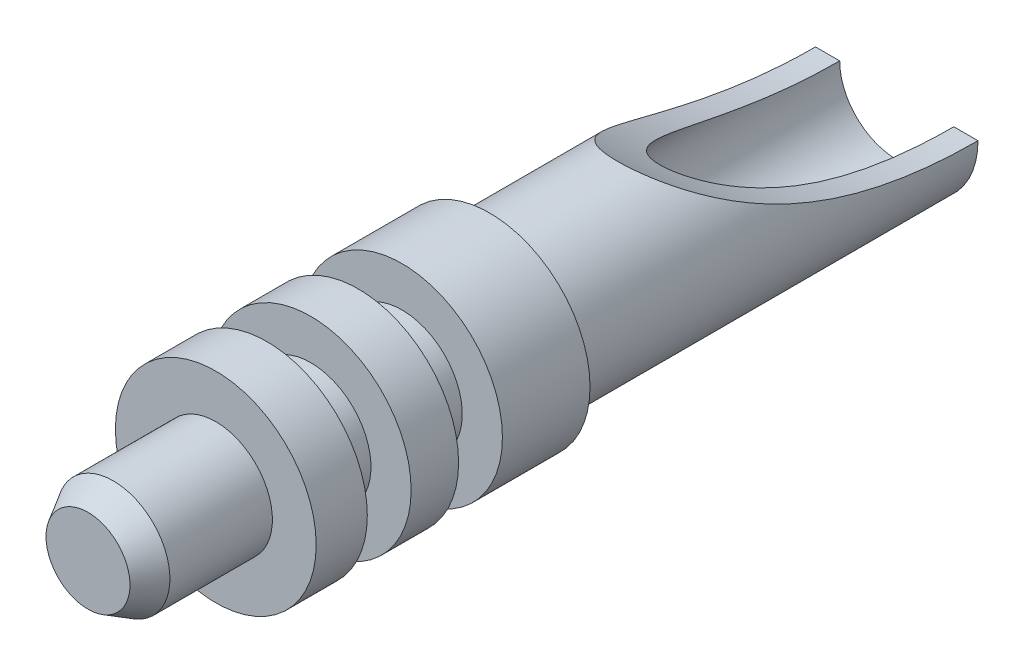
ISO-10303-21;
HEADER;
FILE_DESCRIPTION(('STEP AP214'),'2;1');
FILE_NAME('part.step','',(''),(''),'','','');
FILE_SCHEMA(('AUTOMOTIVE_DESIGN { 1 0 10303 214 1 1 1 1 }'));
ENDSEC;
DATA;
#1=APPLICATION_CONTEXT('core data for automotive mechanical design processes');
#2=APPLICATION_PROTOCOL_DEFINITION('international standard','automotive_design',2000,#1);
#3=PRODUCT_CONTEXT('',#1,'mechanical');
#4=PRODUCT('Part','Part','',(#3));
#5=PRODUCT_RELATED_PRODUCT_CATEGORY('part','',(#4));
#6=PRODUCT_DEFINITION_FORMATION('','',#4);
#7=PRODUCT_DEFINITION_CONTEXT('part definition',#1,'design');
#8=PRODUCT_DEFINITION('design','',#6,#7);
#9=PRODUCT_DEFINITION_SHAPE('','',#8);
#10=(LENGTH_UNIT() NAMED_UNIT(*) SI_UNIT(.MILLI.,.METRE.));
#11=(NAMED_UNIT(*) PLANE_ANGLE_UNIT() SI_UNIT($,.RADIAN.));
#12=(NAMED_UNIT(*) SI_UNIT($,.STERADIAN.) SOLID_ANGLE_UNIT());
#13=UNCERTAINTY_MEASURE_WITH_UNIT(LENGTH_MEASURE(1.E-05),#10,'distance_accuracy_value','');
#14=(GEOMETRIC_REPRESENTATION_CONTEXT(3) GLOBAL_UNCERTAINTY_ASSIGNED_CONTEXT((#13)) GLOBAL_UNIT_ASSIGNED_CONTEXT((#10,
#11,#12)) REPRESENTATION_CONTEXT('',''));
#15=CARTESIAN_POINT('',(0.,0.,0.));
#16=DIRECTION('',(0.,0.,1.));
#17=DIRECTION('',(1.,0.,0.));
#18=AXIS2_PLACEMENT_3D('',#15,#16,#17);
#19=CARTESIAN_POINT('',(0.,0.5842,5.41019971639224));
#20=DIRECTION('',(0.,0.,1.));
#21=DIRECTION('',(1.,0.,0.));
#22=AXIS2_PLACEMENT_3D('',#19,#20,#21);
#23=PLANE('',#22);
#24=CARTESIAN_POINT('',(0.,0.,5.41019971643664));
#25=DIRECTION('',(0.,0.,-1.));
#26=DIRECTION('',(-1.,0.,0.));
#27=AXIS2_PLACEMENT_3D('',#24,#25,#26);
#28=CIRCLE('',#27,0.584199999991597);
#29=CARTESIAN_POINT('',(-0.584199999991597,0.,5.41019971643664));
#30=VERTEX_POINT('',#29);
#31=EDGE_CURVE('E19',#30,#30,#28,.T.);
#32=ORIENTED_EDGE('',*,*,#31,.F.);
#33=EDGE_LOOP('',(#32));
#34=FACE_BOUND('',#33,.T.);
#35=ADVANCED_FACE('F16',(#34),#23,.T.);
#36=CARTESIAN_POINT('',(0.,0.,5.05824699234836));
#37=DIRECTION('',(0.,0.,-1.));
#38=DIRECTION('',(-1.,0.,0.));
#39=AXIS2_PLACEMENT_3D('',#36,#37,#38);
#40=CONICAL_SURFACE('',#39,0.787399999978788,0.52359877558296);
#41=ORIENTED_EDGE('',*,*,#31,.T.);
#42=EDGE_LOOP('',(#41));
#43=FACE_BOUND('',#42,.T.);
#44=CARTESIAN_POINT('',(0.,0.,5.05824699229394));
#45=DIRECTION('',(0.,0.,-1.));
#46=DIRECTION('',(-1.,0.,0.));
#47=AXIS2_PLACEMENT_3D('',#44,#45,#46);
#48=CIRCLE('',#47,0.787400000000188);
#49=CARTESIAN_POINT('',(-0.787400000000188,0.,5.05824699229394));
#50=VERTEX_POINT('',#49);
#51=EDGE_CURVE('E119',#50,#50,#48,.T.);
#52=ORIENTED_EDGE('',*,*,#51,.F.);
#53=EDGE_LOOP('',(#52));
#54=FACE_BOUND('',#53,.T.);
#55=ADVANCED_FACE('F131',(#43,#54),#40,.T.);
#56=CARTESIAN_POINT('',(0.,0.,4.34522335434307));
#57=DIRECTION('',(0.,0.,-1.));
#58=DIRECTION('',(-1.,0.,0.));
#59=AXIS2_PLACEMENT_3D('',#56,#57,#58);
#60=CYLINDRICAL_SURFACE('',#59,0.787400000000188);
#61=ORIENTED_EDGE('',*,*,#51,.T.);
#62=EDGE_LOOP('',(#61));
#63=FACE_BOUND('',#62,.T.);
#64=CARTESIAN_POINT('',(0.,0.,3.63219971639224));
#65=DIRECTION('',(0.,0.,-1.));
#66=DIRECTION('',(-1.,0.,0.));
#67=AXIS2_PLACEMENT_3D('',#64,#65,#66);
#68=CIRCLE('',#67,0.787400000000188);
#69=CARTESIAN_POINT('',(-0.787400000000188,0.,3.63219971639224));
#70=VERTEX_POINT('',#69);
#71=EDGE_CURVE('E122',#70,#70,#68,.T.);
#72=ORIENTED_EDGE('',*,*,#71,.F.);
#73=EDGE_LOOP('',(#72));
#74=FACE_BOUND('',#73,.T.);
#75=ADVANCED_FACE('F138',(#63,#74),#60,.T.);
#76=CARTESIAN_POINT('',(0.,1.39699999999999,3.63219971639224));
#77=DIRECTION('',(0.,0.,1.));
#78=DIRECTION('',(1.,0.,0.));
#79=AXIS2_PLACEMENT_3D('',#76,#77,#78);
#80=PLANE('',#79);
#81=ORIENTED_EDGE('',*,*,#71,.T.);
#82=EDGE_LOOP('',(#81));
#83=FACE_BOUND('',#82,.T.);
#84=CARTESIAN_POINT('',(0.,0.,3.63219971639224));
#85=DIRECTION('',(0.,0.,-1.));
#86=DIRECTION('',(-1.,0.,0.));
#87=AXIS2_PLACEMENT_3D('',#84,#85,#86);
#88=CIRCLE('',#87,1.39699999999999);
#89=CARTESIAN_POINT('',(-1.39699999999999,0.,3.63219971639224));
#90=VERTEX_POINT('',#89);
#91=EDGE_CURVE('E127',#90,#90,#88,.T.);
#92=ORIENTED_EDGE('',*,*,#91,.F.);
#93=EDGE_LOOP('',(#92));
#94=FACE_BOUND('',#93,.T.);
#95=ADVANCED_FACE('F142',(#83,#94),#80,.T.);
#96=CARTESIAN_POINT('',(0.,0.,3.27660004850585));
#97=DIRECTION('',(0.,0.,-1.));
#98=DIRECTION('',(-1.,0.,0.));
#99=AXIS2_PLACEMENT_3D('',#96,#97,#98);
#100=CYLINDRICAL_SURFACE('',#99,1.39699999999999);
#101=ORIENTED_EDGE('',*,*,#91,.T.);
#102=EDGE_LOOP('',(#101));
#103=FACE_BOUND('',#102,.T.);
#104=CARTESIAN_POINT('',(0.,0.,2.92100038061946));
#105=DIRECTION('',(0.,0.,-1.));
#106=DIRECTION('',(-1.,0.,0.));
#107=AXIS2_PLACEMENT_3D('',#104,#105,#106);
#108=CIRCLE('',#107,1.39699999999999);
#109=CARTESIAN_POINT('',(-1.39699999999999,0.,2.92100038061946));
#110=VERTEX_POINT('',#109);
#111=EDGE_CURVE('E200',#110,#110,#108,.T.);
#112=ORIENTED_EDGE('',*,*,#111,.F.);
#113=EDGE_LOOP('',(#112));
#114=FACE_BOUND('',#113,.T.);
#115=ADVANCED_FACE('F147',(#103,#114),#100,.T.);
#116=CARTESIAN_POINT('',(0.,0.838200802978341,2.92100038062489));
#117=DIRECTION('',(0.,0.,-1.));
#118=DIRECTION('',(-1.,0.,0.));
#119=AXIS2_PLACEMENT_3D('',#116,#117,#118);
#120=PLANE('',#119);
#121=CARTESIAN_POINT('',(0.,0.,2.92100038062489));
#122=DIRECTION('',(0.,0.,-1.));
#123=DIRECTION('',(-1.,0.,0.));
#124=AXIS2_PLACEMENT_3D('',#121,#122,#123);
#125=CIRCLE('',#124,0.838200802978341);
#126=CARTESIAN_POINT('',(-0.838200802978341,0.,2.92100038062489));
#127=VERTEX_POINT('',#126);
#128=EDGE_CURVE('E197',#127,#127,#125,.T.);
#129=ORIENTED_EDGE('',*,*,#128,.F.);
#130=EDGE_LOOP('',(#129));
#131=FACE_BOUND('',#130,.T.);
#132=ORIENTED_EDGE('',*,*,#111,.T.);
#133=EDGE_LOOP('',(#132));
#134=FACE_BOUND('',#133,.T.);
#135=ADVANCED_FACE('F151',(#131,#134),#120,.T.);
#136=CARTESIAN_POINT('',(0.,0.,2.61620038062494));
#137=DIRECTION('',(0.,0.,-1.));
#138=DIRECTION('',(-1.,0.,0.));
#139=AXIS2_PLACEMENT_3D('',#136,#137,#138);
#140=CYLINDRICAL_SURFACE('',#139,0.838200802978341);
#141=ORIENTED_EDGE('',*,*,#128,.T.);
#142=EDGE_LOOP('',(#141));
#143=FACE_BOUND('',#142,.T.);
#144=CARTESIAN_POINT('',(0.,0.,2.31140038062501));
#145=DIRECTION('',(0.,0.,-1.));
#146=DIRECTION('',(-1.,0.,0.));
#147=AXIS2_PLACEMENT_3D('',#144,#145,#146);
#148=CIRCLE('',#147,0.838200802978341);
#149=CARTESIAN_POINT('',(-0.838200802978341,0.,2.31140038062501));
#150=VERTEX_POINT('',#149);
#151=EDGE_CURVE('E194',#150,#150,#148,.T.);
#152=ORIENTED_EDGE('',*,*,#151,.F.);
#153=EDGE_LOOP('',(#152));
#154=FACE_BOUND('',#153,.T.);
#155=ADVANCED_FACE('F155',(#143,#154),#140,.T.);
#156=CARTESIAN_POINT('',(0.,1.39700041754873,2.31140038061958));
#157=DIRECTION('',(0.,0.,1.));
#158=DIRECTION('',(1.,0.,0.));
#159=AXIS2_PLACEMENT_3D('',#156,#157,#158);
#160=PLANE('',#159);
#161=ORIENTED_EDGE('',*,*,#151,.T.);
#162=EDGE_LOOP('',(#161));
#163=FACE_BOUND('',#162,.T.);
#164=CARTESIAN_POINT('',(0.,0.,2.31140038061958));
#165=DIRECTION('',(0.,0.,-1.));
#166=DIRECTION('',(-1.,0.,0.));
#167=AXIS2_PLACEMENT_3D('',#164,#165,#166);
#168=CIRCLE('',#167,1.39700020877436);
#169=CARTESIAN_POINT('',(-1.39700020877436,0.,2.31140038061958));
#170=VERTEX_POINT('',#169);
#171=EDGE_CURVE('E191',#170,#170,#168,.T.);
#172=ORIENTED_EDGE('',*,*,#171,.F.);
#173=EDGE_LOOP('',(#172));
#174=FACE_BOUND('',#173,.T.);
#175=ADVANCED_FACE('F159',(#163,#174),#160,.T.);
#176=CARTESIAN_POINT('',(0.,0.,1.98120038061958));
#177=DIRECTION('',(0.,0.,-1.));
#178=DIRECTION('',(-1.,0.,0.));
#179=AXIS2_PLACEMENT_3D('',#176,#177,#178);
#180=CYLINDRICAL_SURFACE('',#179,1.39700020877436);
#181=ORIENTED_EDGE('',*,*,#171,.T.);
#182=EDGE_LOOP('',(#181));
#183=FACE_BOUND('',#182,.T.);
#184=CARTESIAN_POINT('',(0.,0.,1.65100038061958));
#185=DIRECTION('',(0.,0.,-1.));
#186=DIRECTION('',(-1.,0.,0.));
#187=AXIS2_PLACEMENT_3D('',#184,#185,#186);
#188=CIRCLE('',#187,1.39700020877436);
#189=CARTESIAN_POINT('',(-1.39700020877436,0.,1.65100038061958));
#190=VERTEX_POINT('',#189);
#191=EDGE_CURVE('E186',#190,#190,#188,.T.);
#192=ORIENTED_EDGE('',*,*,#191,.F.);
#193=EDGE_LOOP('',(#192));
#194=FACE_BOUND('',#193,.T.);
#195=ADVANCED_FACE('F163',(#183,#194),#180,.T.);
#196=CARTESIAN_POINT('',(0.,0.8382003854296,1.65100038062498));
#197=DIRECTION('',(0.,0.,-1.));
#198=DIRECTION('',(-1.,0.,0.));
#199=AXIS2_PLACEMENT_3D('',#196,#197,#198);
#200=PLANE('',#199);
#201=CARTESIAN_POINT('',(0.,0.,1.65100038062498));
#202=DIRECTION('',(0.,0.,-1.));
#203=DIRECTION('',(-1.,0.,0.));
#204=AXIS2_PLACEMENT_3D('',#201,#202,#203);
#205=CIRCLE('',#204,0.838200192714796);
#206=CARTESIAN_POINT('',(-0.838200192714796,0.,1.65100038062498));
#207=VERTEX_POINT('',#206);
#208=EDGE_CURVE('E179',#207,#207,#205,.T.);
#209=ORIENTED_EDGE('',*,*,#208,.F.);
#210=EDGE_LOOP('',(#209));
#211=FACE_BOUND('',#210,.T.);
#212=ORIENTED_EDGE('',*,*,#191,.T.);
#213=EDGE_LOOP('',(#212));
#214=FACE_BOUND('',#213,.T.);
#215=ADVANCED_FACE('F167',(#211,#214),#200,.T.);
#216=CARTESIAN_POINT('',(0.,0.,1.34620038062512));
#217=DIRECTION('',(0.,0.,-1.));
#218=DIRECTION('',(-1.,0.,0.));
#219=AXIS2_PLACEMENT_3D('',#216,#217,#218);
#220=CYLINDRICAL_SURFACE('',#219,0.838200192714796);
#221=ORIENTED_EDGE('',*,*,#208,.T.);
#222=EDGE_LOOP('',(#221));
#223=FACE_BOUND('',#222,.T.);
#224=CARTESIAN_POINT('',(0.,0.,1.04140038062526));
#225=DIRECTION('',(0.,0.,-1.));
#226=DIRECTION('',(-1.,0.,0.));
#227=AXIS2_PLACEMENT_3D('',#224,#225,#226);
#228=CIRCLE('',#227,0.838200192714796);
#229=CARTESIAN_POINT('',(-0.838200192714796,0.,1.04140038062526));
#230=VERTEX_POINT('',#229);
#231=EDGE_CURVE('E182',#230,#230,#228,.T.);
#232=ORIENTED_EDGE('',*,*,#231,.F.);
#233=EDGE_LOOP('',(#232));
#234=FACE_BOUND('',#233,.T.);
#235=ADVANCED_FACE('F63',(#223,#234),#220,.T.);
#236=CARTESIAN_POINT('',(0.,1.39699999999999,1.04140082350681));
#237=DIRECTION('',(0.,0.,1.));
#238=DIRECTION('',(1.,0.,0.));
#239=AXIS2_PLACEMENT_3D('',#236,#237,#238);
#240=PLANE('',#239);
#241=ORIENTED_EDGE('',*,*,#231,.T.);
#242=EDGE_LOOP('',(#241));
#243=FACE_BOUND('',#242,.T.);
#244=CARTESIAN_POINT('',(0.,0.,1.04140082350681));
#245=DIRECTION('',(0.,0.,-1.));
#246=DIRECTION('',(-1.,0.,0.));
#247=AXIS2_PLACEMENT_3D('',#244,#245,#246);
#248=CIRCLE('',#247,1.39699999999999);
#249=CARTESIAN_POINT('',(-1.39699999999999,0.,1.04140082350681));
#250=VERTEX_POINT('',#249);
#251=EDGE_CURVE('E116',#250,#250,#248,.T.);
#252=ORIENTED_EDGE('',*,*,#251,.F.);
#253=EDGE_LOOP('',(#252));
#254=FACE_BOUND('',#253,.T.);
#255=ADVANCED_FACE('F52',(#243,#254),#240,.T.);
#256=CARTESIAN_POINT('',(0.,0.,-0.177800283609031));
#257=DIRECTION('',(0.,0.,-1.));
#258=DIRECTION('',(-1.,0.,0.));
#259=AXIS2_PLACEMENT_3D('',#256,#257,#258);
#260=CONICAL_SURFACE('',#259,0.793749999900228,0.785398163182607);
#261=CARTESIAN_POINT('',(0.,0.,-0.177800283697822));
#262=DIRECTION('',(0.,0.,-1.));
#263=DIRECTION('',(-1.,0.,0.));
#264=AXIS2_PLACEMENT_3D('',#261,#262,#263);
#265=CIRCLE('',#264,0.793750000006584);
#266=CARTESIAN_POINT('',(-0.793750000006584,0.,-0.177800283697822));
#267=VERTEX_POINT('',#266);
#268=EDGE_CURVE('E114',#267,#267,#265,.T.);
#269=ORIENTED_EDGE('',*,*,#268,.T.);
#270=EDGE_LOOP('',(#269));
#271=FACE_BOUND('',#270,.T.);
#272=CARTESIAN_POINT('',(0.,1.70530256582424E-10,0.615949716461728));
#273=VERTEX_POINT('',#272);
#274=VERTEX_LOOP('',#273);
#275=FACE_BOUND('',#274,.T.);
#276=ADVANCED_FACE('F49',(#271,#275),#260,.F.);
#277=CARTESIAN_POINT('',(0.,0.,0.431800269904497));
#278=DIRECTION('',(0.,0.,-1.));
#279=DIRECTION('',(-1.,0.,0.));
#280=AXIS2_PLACEMENT_3D('',#277,#278,#279);
#281=CYLINDRICAL_SURFACE('',#280,1.39699999999999);
#282=ORIENTED_EDGE('',*,*,#251,.T.);
#283=EDGE_LOOP('',(#282));
#284=FACE_BOUND('',#283,.T.);
#285=CARTESIAN_POINT('',(0.,0.,-0.177800283697821));
#286=DIRECTION('',(0.,0.,-1.));
#287=DIRECTION('',(-1.,0.,0.));
#288=AXIS2_PLACEMENT_3D('',#285,#286,#287);
#289=CIRCLE('',#288,1.39699999999999);
#290=CARTESIAN_POINT('',(-1.39699999999999,0.,-0.177800283697821));
#291=VERTEX_POINT('',#290);
#292=EDGE_CURVE('E112',#291,#291,#289,.T.);
#293=ORIENTED_EDGE('',*,*,#292,.F.);
#294=EDGE_LOOP('',(#293));
#295=FACE_BOUND('',#294,.T.);
#296=ADVANCED_FACE('F51',(#284,#295),#281,.T.);
#297=CARTESIAN_POINT('',(0.,0.,-3.00990014184892));
#298=DIRECTION('',(0.,0.,-1.));
#299=DIRECTION('',(-1.,0.,0.));
#300=AXIS2_PLACEMENT_3D('',#297,#298,#299);
#301=CYLINDRICAL_SURFACE('',#300,0.793750000006584);
#302=ORIENTED_EDGE('',*,*,#268,.F.);
#303=EDGE_LOOP('',(#302));
#304=FACE_BOUND('',#303,.T.);
#305=CARTESIAN_POINT('',(0.,0.,-5.84200000000003));
#306=DIRECTION('',(0.,0.,-1.));
#307=DIRECTION('',(-1.,0.,0.));
#308=AXIS2_PLACEMENT_3D('',#305,#306,#307);
#309=CIRCLE('',#308,0.793750000006584);
#310=CARTESIAN_POINT('',(-0.793750000006584,0.,-5.84200000000001));
#311=VERTEX_POINT('',#310);
#312=CARTESIAN_POINT('',(0.793750000006583,-1.07642140360867E-13,-5.842));
#313=VERTEX_POINT('',#312);
#314=EDGE_CURVE('E45',#311,#313,#309,.F.);
#315=ORIENTED_EDGE('',*,*,#314,.F.);
#316=CARTESIAN_POINT('',(-0.793750000006584,0.,-5.842));
#317=CARTESIAN_POINT('',(-0.793745072714793,4.47134431419849E-08,-5.77563910056315));
#318=CARTESIAN_POINT('',(-0.793750674467001,0.000911709170151779,-5.70928178208783));
#319=CARTESIAN_POINT('',(-0.793739904721889,0.00455739106543424,-5.57661680377649));
#320=CARTESIAN_POINT('',(-0.79372353308365,0.00729142019101399,-5.51030914426166));
#321=CARTESIAN_POINT('',(-0.793576865813522,0.0182289820760601,-5.31146614134481));
#322=CARTESIAN_POINT('',(-0.793348944898373,0.0291679884353135,-5.17907047654982));
#323=CARTESIAN_POINT('',(-0.791731736571994,0.0584418052007496,-4.91383544317004));
#324=CARTESIAN_POINT('',(-0.79033139415905,0.0768461530721461,-4.78100388455027));
#325=CARTESIAN_POINT('',(-0.784793757532293,0.120984599252998,-4.51663359655988));
#326=CARTESIAN_POINT('',(-0.780657270887894,0.146716533559041,-4.38509449734355));
#327=CARTESIAN_POINT('',(-0.770244763805324,0.192460858753782,-4.18136975671162));
#328=CARTESIAN_POINT('',(-0.765711080449191,0.21000779955197,-4.10853571890765));
#329=CARTESIAN_POINT('',(-0.754493369796887,0.247304652771115,-3.96361395815997));
#330=CARTESIAN_POINT('',(-0.747809935979546,0.267053956206744,-3.89152603490013));
#331=CARTESIAN_POINT('',(-0.731632473307787,0.308625129114248,-3.74847945569802));
#332=CARTESIAN_POINT('',(-0.72214629365652,0.330441096409037,-3.6775182215873));
#333=CARTESIAN_POINT('',(-0.699479459381219,0.376054812045032,-3.53683813125736));
#334=CARTESIAN_POINT('',(-0.68629994572098,0.399851946760421,-3.46711889841592));
#335=CARTESIAN_POINT('',(-0.654471742726663,0.450141562589354,-3.32674223509212));
#336=CARTESIAN_POINT('',(-0.63563265181978,0.476702419469,-3.25615140401202));
#337=CARTESIAN_POINT('',(-0.590882851879046,0.531174523504976,-3.11784235861526));
#338=CARTESIAN_POINT('',(-0.564987194272188,0.559082793587976,-3.05011838063773));
#339=CARTESIAN_POINT('',(-0.512494274570774,0.606828171858658,-2.93884195298036));
#340=CARTESIAN_POINT('',(-0.488398997710889,0.626595689509811,-2.89409380081179));
#341=CARTESIAN_POINT('',(-0.433915354885701,0.665492720444561,-2.80826898988383));
#342=CARTESIAN_POINT('',(-0.403543099609246,0.684623724278987,-2.76718330991133));
#343=CARTESIAN_POINT('',(-0.349640571394023,0.712931490359794,-2.70767446967969));
#344=CARTESIAN_POINT('',(-0.328839578711178,0.72283247158768,-2.68713982252322));
#345=CARTESIAN_POINT('',(-0.284307323811903,0.741478672484714,-2.64887487533219));
#346=CARTESIAN_POINT('',(-0.26057920244541,0.750225110482441,-2.6311416151887));
#347=CARTESIAN_POINT('',(-0.215277412068541,0.764286971037071,-2.60286632005315));
#348=CARTESIAN_POINT('',(-0.194268774165629,0.769937974911433,-2.59159545137628));
#349=CARTESIAN_POINT('',(-0.150478304835319,0.779676721874569,-2.57226424226923));
#350=CARTESIAN_POINT('',(-0.127699124724625,0.783766750176207,-2.56419920788718));
#351=CARTESIAN_POINT('',(-0.0843487326262779,0.789511485008108,-2.55289983428004));
#352=CARTESIAN_POINT('',(-0.06395634294216,0.791438804489411,-2.54912367041116));
#353=CARTESIAN_POINT('',(-0.0227473002939425,0.793691704090161,-2.54471127064433));
#354=CARTESIAN_POINT('',(-0.00193086957465204,0.794018102631453,-2.54407343037393));
#355=CARTESIAN_POINT('',(0.039506732925389,0.793037127809266,-2.54599333993579));
#356=CARTESIAN_POINT('',(0.0601279480419586,0.79173012603982,-2.5485503629455));
#357=CARTESIAN_POINT('',(0.100620251475667,0.787610327473623,-2.55663660894271));
#358=CARTESIAN_POINT('',(0.120490806154396,0.784796480262608,-2.56216790529207));
#359=CARTESIAN_POINT('',(0.1648719462376,0.776856104875197,-2.57785138605341));
#360=CARTESIAN_POINT('',(0.188987800635821,0.771289156891959,-2.58889173194683));
#361=CARTESIAN_POINT('',(0.234911624847708,0.758568855847461,-2.61433297532679));
#362=CARTESIAN_POINT('',(0.256714740646138,0.751412260081629,-2.62874074516636));
#363=CARTESIAN_POINT('',(0.309259776611348,0.731819089374931,-2.66858474436038));
#364=CARTESIAN_POINT('',(0.338395314606695,0.718630946940319,-2.69575139801168));
#365=CARTESIAN_POINT('',(0.391846727747439,0.690944456945323,-2.75384577622739));
#366=CARTESIAN_POINT('',(0.416151393600319,0.676443173261403,-2.78478198547757));
#367=CARTESIAN_POINT('',(0.459511078337832,0.647707115429486,-2.84732765458962));
#368=CARTESIAN_POINT('',(0.478783425428324,0.633502661215112,-2.87880310264737));
#369=CARTESIAN_POINT('',(0.514378537111737,0.604958306501471,-2.94333969322483));
#370=CARTESIAN_POINT('',(0.530698561867391,0.590618293051567,-2.97640227301385));
#371=CARTESIAN_POINT('',(0.560894456647505,0.562022558686372,-3.04374816949809));
#372=CARTESIAN_POINT('',(0.574764841621003,0.54776709431636,-3.07803402414673));
#373=CARTESIAN_POINT('',(0.600404783274252,0.519534458058143,-3.14746863255609));
#374=CARTESIAN_POINT('',(0.612175091269772,0.505557188240448,-3.18261707258158));
#375=CARTESIAN_POINT('',(0.638408688896,0.472322874976223,-3.26816641354489));
#376=CARTESIAN_POINT('',(0.651995307197426,0.45325266253917,-3.31890806971213));
#377=CARTESIAN_POINT('',(0.676336508990074,0.416052136808957,-3.42141307327005));
#378=CARTESIAN_POINT('',(0.687089828390324,0.397922245932515,-3.47317686565835));
#379=CARTESIAN_POINT('',(0.715950737778844,0.34507906167727,-3.62978750308774));
#380=CARTESIAN_POINT('',(0.730619389353738,0.31196774129816,-3.73581132009913));
#381=CARTESIAN_POINT('',(0.753952739367213,0.250350456127041,-3.95045816664053));
#382=CARTESIAN_POINT('',(0.762580900618215,0.221873303655325,-4.05909297145223));
#383=CARTESIAN_POINT('',(0.775797409755612,0.169979254672727,-4.27770215798248));
#384=CARTESIAN_POINT('',(0.780388977239767,0.146558336566351,-4.38767540104308));
#385=CARTESIAN_POINT('',(0.787106871049683,0.104664731840435,-4.60964321194316));
#386=CARTESIAN_POINT('',(0.789210788722427,0.0862381593983793,-4.72164706102088));
#387=CARTESIAN_POINT('',(0.792024078559455,0.0546608981445967,-4.9464361385479));
#388=CARTESIAN_POINT('',(0.792733118644014,0.0415114662592921,-5.05922154665178));
#389=CARTESIAN_POINT('',(0.793548030166539,0.0206848541948833,-5.28358018396129));
#390=CARTESIAN_POINT('',(0.793662865992193,0.0129278823684445,-5.3951459320824));
#391=CARTESIAN_POINT('',(0.793736715299938,0.00517123240290424,-5.56264753256495));
#392=CARTESIAN_POINT('',(0.793744936281703,0.00323215046426472,-5.61849967962116));
#393=CARTESIAN_POINT('',(0.793750325389373,0.000646537018439649,-5.73023387458225));
#394=CARTESIAN_POINT('',(0.793747493517524,5.24863010660097E-09,-5.78611592248105));
#395=CARTESIAN_POINT('',(0.793750000006583,-1.07402628612572E-13,-5.842));
#396=B_SPLINE_CURVE_WITH_KNOTS('',3,(#316,#317,#318,#319,#320,#321,#322,#323,#324,#325,#326,
#327,#328,#329,#330,#331,#332,#333,#334,#335,#336,#337,#338,#339,#340,#341,#342,#343,#344,#345,
#346,#347,#348,#349,#350,#351,#352,#353,#354,#355,#356,#357,#358,#359,#360,#361,#362,#363,#364,
#365,#366,#367,#368,#369,#370,#371,#372,#373,#374,#375,#376,#377,#378,#379,#380,#381,#382,#383,
#384,#385,#386,#387,#388,#389,#390,#391,#392,#393,#394,#395),.UNSPECIFIED.,.F.,.F.,(4,2,2,2,2,2,
2,2,2,2,2,2,2,2,2,2,2,2,2,2,2,2,2,2,2,2,2,2,2,2,2,2,2,2,2,2,2,2,2,4),(0.,0.199069277043777,
0.398139830750915,0.796459803533338,1.19857847810447,1.60057852079743,1.82569030968455,
2.05074000551331,2.2751653199953,2.49952138013613,2.73248361349462,2.96495278371441,
3.12824318061488,3.29111956340222,3.38349228125217,3.47576673023047,3.54900939437878,
3.62214441876734,3.68434904400335,3.74652186571123,3.80868054584931,3.87088261299867,
3.9517315426995,4.03274693504561,4.15792642441056,4.28339306698314,4.40185501628169,
4.52042634381554,4.63925989117591,4.75805083946715,4.92558369823146,5.0931911765633,
5.42887754111278,5.76657723065022,6.10400732501941,6.44445436531979,6.78498244634083,
7.12035789416721,7.2880023631975,7.45564679816532),.UNSPECIFIED.);
#397=EDGE_CURVE('E88',#311,#313,#396,.T.);
#398=ORIENTED_EDGE('',*,*,#397,.T.);
#399=EDGE_LOOP('',(#315,#398));
#400=FACE_BOUND('',#399,.T.);
#401=ADVANCED_FACE('F60',(#304,#400),#301,.F.);
#402=CARTESIAN_POINT('',(0.,1.13030000001319,-0.177800283697821));
#403=DIRECTION('',(0.,0.,-1.));
#404=DIRECTION('',(-1.,0.,0.));
#405=AXIS2_PLACEMENT_3D('',#402,#403,#404);
#406=PLANE('',#405);
#407=CARTESIAN_POINT('',(0.,0.,-0.177800283697822));
#408=DIRECTION('',(0.,0.,-1.));
#409=DIRECTION('',(-1.,0.,0.));
#410=AXIS2_PLACEMENT_3D('',#407,#408,#409);
#411=CIRCLE('',#410,1.1303000000066);
#412=CARTESIAN_POINT('',(-1.1303000000066,0.,-0.177800283697822));
#413=VERTEX_POINT('',#412);
#414=EDGE_CURVE('E11',#413,#413,#411,.T.);
#415=ORIENTED_EDGE('',*,*,#414,.F.);
#416=EDGE_LOOP('',(#415));
#417=FACE_BOUND('',#416,.T.);
#418=ORIENTED_EDGE('',*,*,#292,.T.);
#419=EDGE_LOOP('',(#418));
#420=FACE_BOUND('',#419,.T.);
#421=ADVANCED_FACE('F100',(#417,#420),#406,.T.);
#422=CARTESIAN_POINT('',(0.,0.79375,-5.842));
#423=DIRECTION('',(0.,0.,-1.));
#424=DIRECTION('',(-1.,0.,0.));
#425=AXIS2_PLACEMENT_3D('',#422,#423,#424);
#426=PLANE('',#425);
#427=DIRECTION('',(1.,0.,0.));
#428=VECTOR('',#427,1.);
#429=CARTESIAN_POINT('',(1.30985766934386E-13,0.,-5.84200000000002));
#430=LINE('',#429,#428);
#431=CARTESIAN_POINT('',(1.1303000000066,-1.21338772118349E-13,-5.842));
#432=VERTEX_POINT('',#431);
#433=EDGE_CURVE('E108',#313,#432,#430,.T.);
#434=ORIENTED_EDGE('',*,*,#433,.T.);
#435=CARTESIAN_POINT('',(0.,0.,-5.842));
#436=DIRECTION('',(0.,0.,-1.));
#437=DIRECTION('',(-1.,0.,0.));
#438=AXIS2_PLACEMENT_3D('',#435,#436,#437);
#439=CIRCLE('',#438,1.1303000000066);
#440=CARTESIAN_POINT('',(-1.1303000000066,0.,-5.84200000000002));
#441=VERTEX_POINT('',#440);
#442=EDGE_CURVE('E25',#441,#432,#439,.F.);
#443=ORIENTED_EDGE('',*,*,#442,.F.);
#444=DIRECTION('',(1.,0.,0.));
#445=VECTOR('',#444,1.);
#446=CARTESIAN_POINT('',(1.30985766934384E-13,0.,-5.84199999999997));
#447=LINE('',#446,#445);
#448=EDGE_CURVE('E95',#441,#311,#447,.T.);
#449=ORIENTED_EDGE('',*,*,#448,.T.);
#450=ORIENTED_EDGE('',*,*,#314,.T.);
#451=EDGE_LOOP('',(#434,#443,#449,#450));
#452=FACE_BOUND('',#451,.T.);
#453=ADVANCED_FACE('F75',(#452),#426,.T.);
#454=CARTESIAN_POINT('',(4.19031679890433E-13,7.24591981105692,-5.842));
#455=DIRECTION('',(1.,0.,0.));
#456=DIRECTION('',(0.,1.,0.));
#457=AXIS2_PLACEMENT_3D('',#454,#455,#456);
#458=CYLINDRICAL_SURFACE('',#457,7.245919811057);
#459=ORIENTED_EDGE('',*,*,#448,.F.);
#460=CARTESIAN_POINT('',(1.1303000000066,-1.21417072801188E-13,-5.842));
#461=CARTESIAN_POINT('',(1.13027922073295,-1.0856042204325E-06,-5.74595397538415));
#462=CARTESIAN_POINT('',(1.13029927365783,0.00190962221959341,-5.64990798210759));
#463=CARTESIAN_POINT('',(1.13027169562796,0.00954700347392156,-5.45796363835748));
#464=CARTESIAN_POINT('',(1.13022406171017,0.0152738439522964,-5.36206529453136));
#465=CARTESIAN_POINT('',(1.12991130641871,0.0305569275643506,-5.17030803073961));
#466=CARTESIAN_POINT('',(1.12964558520041,0.0401236952123167,-5.07444994994745));
#467=CARTESIAN_POINT('',(1.12859783048165,0.0630704690742066,-4.88319622709102));
#468=CARTESIAN_POINT('',(1.12781581171734,0.0764503664477951,-4.7878005719065));
#469=CARTESIAN_POINT('',(1.12533710580411,0.106891677502504,-4.59830622792761));
#470=CARTESIAN_POINT('',(1.12364697251541,0.12392619306812,-4.5042031408764));
#471=CARTESIAN_POINT('',(1.1188362768455,0.161698099260662,-4.3167806808706));
#472=CARTESIAN_POINT('',(1.11571577481791,0.182435333630873,-4.22346127501818));
#473=CARTESIAN_POINT('',(1.10739957808593,0.227528675021003,-4.03793812597343));
#474=CARTESIAN_POINT('',(1.1022069817626,0.25187934491288,-3.94573292785677));
#475=CARTESIAN_POINT('',(1.08894746464063,0.30413733761125,-3.76255900536585));
#476=CARTESIAN_POINT('',(1.08088137214526,0.332043633998655,-3.67158993250741));
#477=CARTESIAN_POINT('',(1.06539748077918,0.377886783659841,-3.531982130244));
#478=CARTESIAN_POINT('',(1.05933504586406,0.394627405982293,-3.48279818063623));
#479=CARTESIAN_POINT('',(1.04584632718759,0.429098122982193,-3.38497167850433));
#480=CARTESIAN_POINT('',(1.03842008077581,0.446828190553291,-3.3363291111925));
#481=CARTESIAN_POINT('',(1.01369207095322,0.501626214262065,-3.19084732730463));
#482=CARTESIAN_POINT('',(0.993988856967758,0.540147652731032,-3.0949234746035));
#483=CARTESIAN_POINT('',(0.953980275244724,0.60701309725412,-2.93804867213609));
#484=CARTESIAN_POINT('',(0.936068509192591,0.634465314423898,-2.87610597075144));
#485=CARTESIAN_POINT('',(0.8955316479135,0.690507602603299,-2.75421442137698));
#486=CARTESIAN_POINT('',(0.87290300402502,0.719098517116214,-2.69426711419263));
#487=CARTESIAN_POINT('',(0.822073103822238,0.776685026972787,-2.57756146974296));
#488=CARTESIAN_POINT('',(0.793912876903528,0.805676263292606,-2.52078338477578));
#489=CARTESIAN_POINT('',(0.7306988754887,0.863416713015041,-2.41113662606744));
#490=CARTESIAN_POINT('',(0.695659903397217,0.892166310250554,-2.35825988738032));
#491=CARTESIAN_POINT('',(0.629487023930969,0.939370687970391,-2.27375706713438));
#492=CARTESIAN_POINT('',(0.60055003235294,0.958236950118211,-2.24065093375772));
#493=CARTESIAN_POINT('',(0.538222802227507,0.994583777038289,-2.17792266577088));
#494=CARTESIAN_POINT('',(0.504828852450851,1.01206316743459,-2.14830347378258));
#495=CARTESIAN_POINT('',(0.432903311097379,1.04486923869048,-2.09348594779525));
#496=CARTESIAN_POINT('',(0.394319559130946,1.06017030492407,-2.06833946690346));
#497=CARTESIAN_POINT('',(0.312450864544377,1.0871042417902,-2.02453882989633));
#498=CARTESIAN_POINT('',(0.26917596913673,1.09874475153331,-2.00587114480945));
#499=CARTESIAN_POINT('',(0.1883308360043,1.11509606306809,-1.9798061513293));
#500=CARTESIAN_POINT('',(0.151450305352209,1.12074531120149,-1.97087109793088));
#501=CARTESIAN_POINT('',(0.0763768168082536,1.12834498778049,-1.95887170400309));
#502=CARTESIAN_POINT('',(0.0381851510630974,1.13029895716054,-1.95580174332518));
#503=CARTESIAN_POINT('',(-0.0357500488676119,1.1303009763494,-1.95579891715973));
#504=CARTESIAN_POINT('',(-0.0714943874542414,1.12859016397461,-1.95848716817041));
#505=CARTESIAN_POINT('',(-0.14189894198418,1.12191547877851,-1.96902148193763));
#506=CARTESIAN_POINT('',(-0.176558762594738,1.11695043385792,-1.97686940309111));
#507=CARTESIAN_POINT('',(-0.243732982573798,1.10423556102709,-1.99710626305225));
#508=CARTESIAN_POINT('',(-0.276258596855741,1.09650194994204,-2.00946876607975));
#509=CARTESIAN_POINT('',(-0.338898866298311,1.07878967584746,-2.0380358932559));
#510=CARTESIAN_POINT('',(-0.369012487740316,1.06881005716323,-2.05424215307897));
#511=CARTESIAN_POINT('',(-0.443674478410606,1.04073589164672,-2.10032476706928));
#512=CARTESIAN_POINT('',(-0.486235881546523,1.02133107628382,-2.13261966377838));
#513=CARTESIAN_POINT('',(-0.564969979712687,0.979988151600875,-2.2028896103724));
#514=CARTESIAN_POINT('',(-0.601124846193442,0.958043245289379,-2.2408799847069));
#515=CARTESIAN_POINT('',(-0.661797779614422,0.916894195269329,-2.31379614288939));
#516=CARTESIAN_POINT('',(-0.687243347886198,0.897890332127913,-2.3480785312602));
#517=CARTESIAN_POINT('',(-0.734693412520999,0.859496423212454,-2.418759780242));
#518=CARTESIAN_POINT('',(-0.756695540780655,0.840106121920961,-2.45516007397245));
#519=CARTESIAN_POINT('',(-0.818217970723198,0.781860479899401,-2.56689450415692));
#520=CARTESIAN_POINT('',(-0.853208533237062,0.742963800227533,-2.64470362229126));
#521=CARTESIAN_POINT('',(-0.91327546612109,0.667656004122175,-2.80270230469888));
#522=CARTESIAN_POINT('',(-0.938551202227189,0.631209200360978,-2.88280308993953));
#523=CARTESIAN_POINT('',(-0.982338249638866,0.560636457971038,-3.0458883863084));
#524=CARTESIAN_POINT('',(-1.00084305966961,0.526512775394168,-3.12887558563419));
#525=CARTESIAN_POINT('',(-1.0327075736601,0.460900108449845,-3.29738017851201));
#526=CARTESIAN_POINT('',(-1.04603752536841,0.429427151165229,-3.38290924574459));
#527=CARTESIAN_POINT('',(-1.06864162990506,0.369600026972141,-3.55553462169422));
#528=CARTESIAN_POINT('',(-1.07791697074498,0.341244948342032,-3.64263046354455));
#529=CARTESIAN_POINT('',(-1.09325606494503,0.288294813719486,-3.81643627270427));
#530=CARTESIAN_POINT('',(-1.09937658564383,0.263639404006052,-3.90312304526038));
#531=CARTESIAN_POINT('',(-1.10941688244268,0.217550553594538,-4.07748504842233));
#532=CARTESIAN_POINT('',(-1.11333629665802,0.196117643132626,-4.16516043915153));
#533=CARTESIAN_POINT('',(-1.11959082826964,0.156513633988187,-4.34138727604788));
#534=CARTESIAN_POINT('',(-1.12192439997667,0.138345730289764,-4.429939491815));
#535=CARTESIAN_POINT('',(-1.12550375029235,0.105332478488454,-4.60768336714503));
#536=CARTESIAN_POINT('',(-1.12674950401829,0.0904872063931385,-4.69687504128784));
#537=CARTESIAN_POINT('',(-1.12853528599521,0.0644416942282194,-4.87373650389686));
#538=CARTESIAN_POINT('',(-1.12909062075634,0.0531666890520566,-4.96139515695193));
#539=CARTESIAN_POINT('',(-1.12983476002706,0.0338303459769045,-5.13706844347176));
#540=CARTESIAN_POINT('',(-1.13002356078687,0.0257690409558582,-5.22508308056912));
#541=CARTESIAN_POINT('',(-1.13024597382651,0.0128830288457581,-5.40119047153286));
#542=CARTESIAN_POINT('',(-1.1302798635384,0.00805254889341049,-5.48928280292704));
#543=CARTESIAN_POINT('',(-1.13029948311709,0.00161068055289868,-5.66558340999959));
#544=CARTESIAN_POINT('',(-1.13028521390367,-7.69313252031503E-07,-5.75379168343147));
#545=CARTESIAN_POINT('',(-1.13030000000675,0.,-5.84199999999999));
#546=B_SPLINE_CURVE_WITH_KNOTS('',3,(#460,#461,#462,#463,#464,#465,#466,#467,#468,#469,#470,
#471,#472,#473,#474,#475,#476,#477,#478,#479,#480,#481,#482,#483,#484,#485,#486,#487,#488,#489,
#490,#491,#492,#493,#494,#495,#496,#497,#498,#499,#500,#501,#502,#503,#504,#505,#506,#507,#508,
#509,#510,#511,#512,#513,#514,#515,#516,#517,#518,#519,#520,#521,#522,#523,#524,#525,#526,#527,
#528,#529,#530,#531,#532,#533,#534,#535,#536,#537,#538,#539,#540,#541,#542,#543,#544,#545),
.UNSPECIFIED.,.F.,.F.,(4,2,2,2,2,2,2,2,2,2,2,2,2,2,2,2,2,2,2,2,2,2,2,2,2,2,2,2,2,2,2,2,2,2,2,2,
2,2,2,2,2,2,4),(0.,0.288119037922124,0.576250688831065,0.86517750629803,1.154096077588,
1.44095699399032,1.72780580756826,2.0142272967593,2.30056628987896,2.45746033191678,
2.61435007787161,2.92961599192899,3.13970981619546,3.34996227511414,3.55871041682981,
3.76701418132527,3.91027543966939,4.05365674213784,4.19860505161646,4.34324883380242,
4.45775935420375,4.57216009124914,4.67926538809883,4.78640928301312,4.89293558623343,
4.99950730230754,5.16906182586253,5.33908103008672,5.47907853663773,5.61917190238911,
5.89960045512088,6.17392016934871,6.44850259161708,6.72464110607955,7.00069865691579,
7.27159834999941,7.54254256876843,7.81375049418515,8.08496462304285,8.35005207071471,
8.61514223030925,8.87975745025317,9.14436761644922),.UNSPECIFIED.);
#547=EDGE_CURVE('E34',#432,#441,#546,.T.);
#548=ORIENTED_EDGE('',*,*,#547,.F.);
#549=ORIENTED_EDGE('',*,*,#433,.F.);
#550=ORIENTED_EDGE('',*,*,#397,.F.);
#551=EDGE_LOOP('',(#459,#548,#549,#550));
#552=FACE_BOUND('',#551,.T.);
#553=ADVANCED_FACE('F69',(#552),#458,.F.);
#554=CARTESIAN_POINT('',(0.,0.,-3.00990014184892));
#555=DIRECTION('',(0.,0.,-1.));
#556=DIRECTION('',(-1.,0.,0.));
#557=AXIS2_PLACEMENT_3D('',#554,#555,#556);
#558=CYLINDRICAL_SURFACE('',#557,1.1303000000066);
#559=ORIENTED_EDGE('',*,*,#414,.T.);
#560=EDGE_LOOP('',(#559));
#561=FACE_BOUND('',#560,.T.);
#562=ORIENTED_EDGE('',*,*,#442,.T.);
#563=ORIENTED_EDGE('',*,*,#547,.T.);
#564=EDGE_LOOP('',(#562,#563));
#565=FACE_BOUND('',#564,.T.);
#566=ADVANCED_FACE('F67',(#561,#565),#558,.T.);
#567=CLOSED_SHELL('',(#35,#55,#75,#95,#115,#135,#155,#175,#195,#215,#235,#255,#276,#296,#401,
#421,#453,#553,#566));
#568=MANIFOLD_SOLID_BREP('B1',#567);
#569=ADVANCED_BREP_SHAPE_REPRESENTATION('',(#18,#568),#14);
#570=SHAPE_DEFINITION_REPRESENTATION(#9,#569);
ENDSEC;
END-ISO-10303-21;
